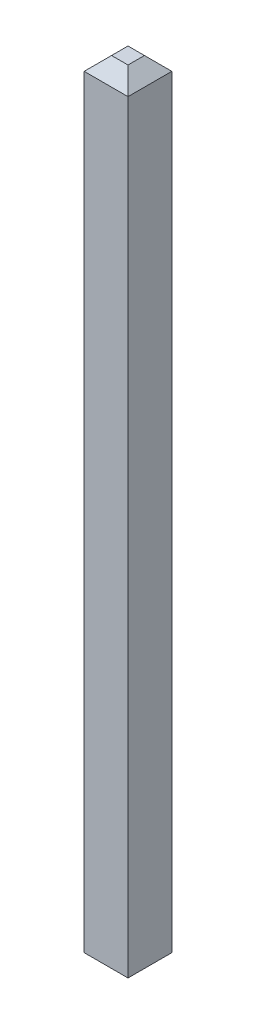
ISO-10303-21;
HEADER;
FILE_DESCRIPTION(('STEP AP214'),'2;1');
FILE_NAME('part.step','',(''),(''),'','','');
FILE_SCHEMA(('AUTOMOTIVE_DESIGN { 1 0 10303 214 1 1 1 1 }'));
ENDSEC;
DATA;
#1=APPLICATION_CONTEXT('core data for automotive mechanical design processes');
#2=APPLICATION_PROTOCOL_DEFINITION('international standard','automotive_design',2000,#1);
#3=PRODUCT_CONTEXT('',#1,'mechanical');
#4=PRODUCT('Part','Part','',(#3));
#5=PRODUCT_RELATED_PRODUCT_CATEGORY('part','',(#4));
#6=PRODUCT_DEFINITION_FORMATION('','',#4);
#7=PRODUCT_DEFINITION_CONTEXT('part definition',#1,'design');
#8=PRODUCT_DEFINITION('design','',#6,#7);
#9=PRODUCT_DEFINITION_SHAPE('','',#8);
#10=(LENGTH_UNIT() NAMED_UNIT(*) SI_UNIT(.MILLI.,.METRE.));
#11=(NAMED_UNIT(*) PLANE_ANGLE_UNIT() SI_UNIT($,.RADIAN.));
#12=(NAMED_UNIT(*) SI_UNIT($,.STERADIAN.) SOLID_ANGLE_UNIT());
#13=UNCERTAINTY_MEASURE_WITH_UNIT(LENGTH_MEASURE(1.E-05),#10,'distance_accuracy_value','');
#14=(GEOMETRIC_REPRESENTATION_CONTEXT(3) GLOBAL_UNCERTAINTY_ASSIGNED_CONTEXT((#13)) GLOBAL_UNIT_ASSIGNED_CONTEXT((#10,
#11,#12)) REPRESENTATION_CONTEXT('',''));
#15=CARTESIAN_POINT('',(0.,0.,0.));
#16=DIRECTION('',(0.,0.,1.));
#17=DIRECTION('',(1.,0.,0.));
#18=AXIS2_PLACEMENT_3D('',#15,#16,#17);
#19=CARTESIAN_POINT('',(4.13,7.07,-0.32));
#20=DIRECTION('',(-0.707106781186548,-0.707106781186548,0.));
#21=DIRECTION('',(-0.707106781186548,0.707106781186548,0.));
#22=AXIS2_PLACEMENT_3D('',#19,#20,#21);
#23=PLANE('',#22);
#24=DIRECTION('',(0.577350269189626,-0.577350269189626,0.577350269189626));
#25=VECTOR('',#24,1.);
#26=CARTESIAN_POINT('',(3.916666666667,7.283333333333,0.106666666667));
#27=LINE('',#26,#25);
#28=CARTESIAN_POINT('',(3.93,7.27,0.12));
#29=VERTEX_POINT('',#28);
#30=CARTESIAN_POINT('',(4.13,7.07,0.32));
#31=VERTEX_POINT('',#30);
#32=EDGE_CURVE('E73',#29,#31,#27,.T.);
#33=ORIENTED_EDGE('',*,*,#32,.T.);
#34=DIRECTION('',(0.,0.,1.));
#35=VECTOR('',#34,1.);
#36=CARTESIAN_POINT('',(4.13,7.07,-0.32));
#37=LINE('',#36,#35);
#38=CARTESIAN_POINT('',(4.13,7.07,-0.32));
#39=VERTEX_POINT('',#38);
#40=EDGE_CURVE('E169',#39,#31,#37,.T.);
#41=ORIENTED_EDGE('',*,*,#40,.F.);
#42=DIRECTION('',(0.577350269189626,-0.577350269189626,-0.577350269189626));
#43=VECTOR('',#42,1.);
#44=CARTESIAN_POINT('',(4.13,7.07,-0.32));
#45=LINE('',#44,#43);
#46=CARTESIAN_POINT('',(3.93,7.27,-0.12));
#47=VERTEX_POINT('',#46);
#48=EDGE_CURVE('E11',#47,#39,#45,.T.);
#49=ORIENTED_EDGE('',*,*,#48,.F.);
#50=DIRECTION('',(0.,0.,-1.));
#51=VECTOR('',#50,1.);
#52=CARTESIAN_POINT('',(3.93,7.27,-0.32));
#53=LINE('',#52,#51);
#54=EDGE_CURVE('E172',#29,#47,#53,.T.);
#55=ORIENTED_EDGE('',*,*,#54,.F.);
#56=EDGE_LOOP('',(#33,#41,#49,#55));
#57=FACE_BOUND('',#56,.T.);
#58=ADVANCED_FACE('F17',(#57),#23,.F.);
#59=CARTESIAN_POINT('',(3.81,7.07,-0.32));
#60=DIRECTION('',(0.,0.707106781186548,-0.707106781186548));
#61=DIRECTION('',(-1.,0.,0.));
#62=AXIS2_PLACEMENT_3D('',#59,#60,#61);
#63=PLANE('',#62);
#64=DIRECTION('',(0.577350269189626,0.577350269189626,0.577350269189626));
#65=VECTOR('',#64,1.);
#66=CARTESIAN_POINT('',(3.623333333333,7.203333333333,-0.186666666667));
#67=LINE('',#66,#65);
#68=CARTESIAN_POINT('',(3.49,7.07,-0.32));
#69=VERTEX_POINT('',#68);
#70=CARTESIAN_POINT('',(3.69,7.27,-0.12));
#71=VERTEX_POINT('',#70);
#72=EDGE_CURVE('E27',#69,#71,#67,.T.);
#73=ORIENTED_EDGE('',*,*,#72,.T.);
#74=DIRECTION('',(-1.,0.,0.));
#75=VECTOR('',#74,1.);
#76=CARTESIAN_POINT('',(3.49,7.27,-0.12));
#77=LINE('',#76,#75);
#78=EDGE_CURVE('E176',#47,#71,#77,.T.);
#79=ORIENTED_EDGE('',*,*,#78,.F.);
#80=ORIENTED_EDGE('',*,*,#48,.T.);
#81=DIRECTION('',(1.,0.,0.));
#82=VECTOR('',#81,1.);
#83=CARTESIAN_POINT('',(4.13,7.07,-0.32));
#84=LINE('',#83,#82);
#85=EDGE_CURVE('E131',#69,#39,#84,.T.);
#86=ORIENTED_EDGE('',*,*,#85,.F.);
#87=EDGE_LOOP('',(#73,#79,#80,#86));
#88=FACE_BOUND('',#87,.T.);
#89=ADVANCED_FACE('F19',(#88),#63,.T.);
#90=CARTESIAN_POINT('',(3.69,7.27,-0.32));
#91=DIRECTION('',(0.707106781186548,-0.707106781186548,0.));
#92=DIRECTION('',(0.,0.,-1.));
#93=AXIS2_PLACEMENT_3D('',#90,#91,#92);
#94=PLANE('',#93);
#95=DIRECTION('',(-0.577350269189626,-0.577350269189626,0.577350269189626));
#96=VECTOR('',#95,1.);
#97=CARTESIAN_POINT('',(3.623333333333,7.203333333333,0.186666666667));
#98=LINE('',#97,#96);
#99=CARTESIAN_POINT('',(3.69,7.27,0.12));
#100=VERTEX_POINT('',#99);
#101=CARTESIAN_POINT('',(3.49,7.07,0.32));
#102=VERTEX_POINT('',#101);
#103=EDGE_CURVE('E40',#100,#102,#98,.T.);
#104=ORIENTED_EDGE('',*,*,#103,.F.);
#105=DIRECTION('',(0.,0.,1.));
#106=VECTOR('',#105,1.);
#107=CARTESIAN_POINT('',(3.69,7.27,-0.32));
#108=LINE('',#107,#106);
#109=EDGE_CURVE('E113',#71,#100,#108,.T.);
#110=ORIENTED_EDGE('',*,*,#109,.F.);
#111=ORIENTED_EDGE('',*,*,#72,.F.);
#112=DIRECTION('',(0.,0.,-1.));
#113=VECTOR('',#112,1.);
#114=CARTESIAN_POINT('',(3.49,7.07,-0.32));
#115=LINE('',#114,#113);
#116=EDGE_CURVE('E110',#102,#69,#115,.T.);
#117=ORIENTED_EDGE('',*,*,#116,.F.);
#118=EDGE_LOOP('',(#104,#110,#111,#117));
#119=FACE_BOUND('',#118,.T.);
#120=ADVANCED_FACE('F109',(#119),#94,.F.);
#121=CARTESIAN_POINT('',(3.49,7.27,0.12));
#122=DIRECTION('',(0.,-0.707106781186548,-0.707106781186548));
#123=DIRECTION('',(0.,-0.707106781186548,0.707106781186548));
#124=AXIS2_PLACEMENT_3D('',#121,#122,#123);
#125=PLANE('',#124);
#126=ORIENTED_EDGE('',*,*,#32,.F.);
#127=DIRECTION('',(1.,0.,0.));
#128=VECTOR('',#127,1.);
#129=CARTESIAN_POINT('',(3.49,7.27,0.12));
#130=LINE('',#129,#128);
#131=EDGE_CURVE('E181',#100,#29,#130,.T.);
#132=ORIENTED_EDGE('',*,*,#131,.F.);
#133=ORIENTED_EDGE('',*,*,#103,.T.);
#134=DIRECTION('',(-1.,0.,0.));
#135=VECTOR('',#134,1.);
#136=CARTESIAN_POINT('',(3.81,7.07,0.32));
#137=LINE('',#136,#135);
#138=EDGE_CURVE('E164',#31,#102,#137,.T.);
#139=ORIENTED_EDGE('',*,*,#138,.F.);
#140=EDGE_LOOP('',(#126,#132,#133,#139));
#141=FACE_BOUND('',#140,.T.);
#142=ADVANCED_FACE('F197',(#141),#125,.F.);
#143=CARTESIAN_POINT('',(3.49,7.27,-0.32));
#144=DIRECTION('',(0.,-1.,0.));
#145=DIRECTION('',(0.,0.,-1.));
#146=AXIS2_PLACEMENT_3D('',#143,#144,#145);
#147=PLANE('',#146);
#148=ORIENTED_EDGE('',*,*,#54,.T.);
#149=ORIENTED_EDGE('',*,*,#78,.T.);
#150=ORIENTED_EDGE('',*,*,#109,.T.);
#151=ORIENTED_EDGE('',*,*,#131,.T.);
#152=EDGE_LOOP('',(#148,#149,#150,#151));
#153=FACE_BOUND('',#152,.T.);
#154=ADVANCED_FACE('F207',(#153),#147,.F.);
#155=CARTESIAN_POINT('',(4.13,7.27,-0.32));
#156=DIRECTION('',(-1.,0.,0.));
#157=DIRECTION('',(0.,1.,0.));
#158=AXIS2_PLACEMENT_3D('',#155,#156,#157);
#159=PLANE('',#158);
#160=DIRECTION('',(0.,-1.,0.));
#161=VECTOR('',#160,1.);
#162=CARTESIAN_POINT('',(4.13,7.27,-0.32));
#163=LINE('',#162,#161);
#164=CARTESIAN_POINT('',(4.13,-4.07,-0.32));
#165=VERTEX_POINT('',#164);
#166=EDGE_CURVE('E135',#39,#165,#163,.T.);
#167=ORIENTED_EDGE('',*,*,#166,.F.);
#168=ORIENTED_EDGE('',*,*,#40,.T.);
#169=DIRECTION('',(0.,-1.,0.));
#170=VECTOR('',#169,1.);
#171=CARTESIAN_POINT('',(4.13,7.27,0.32));
#172=LINE('',#171,#170);
#173=CARTESIAN_POINT('',(4.13,-4.07,0.32));
#174=VERTEX_POINT('',#173);
#175=EDGE_CURVE('E161',#31,#174,#172,.T.);
#176=ORIENTED_EDGE('',*,*,#175,.T.);
#177=DIRECTION('',(0.,0.,-1.));
#178=VECTOR('',#177,1.);
#179=CARTESIAN_POINT('',(4.13,-4.07,-0.32));
#180=LINE('',#179,#178);
#181=EDGE_CURVE('E165',#174,#165,#180,.T.);
#182=ORIENTED_EDGE('',*,*,#181,.T.);
#183=EDGE_LOOP('',(#167,#168,#176,#182));
#184=FACE_BOUND('',#183,.T.);
#185=ADVANCED_FACE('F212',(#184),#159,.F.);
#186=CARTESIAN_POINT('',(3.81,1.5,0.32));
#187=DIRECTION('',(0.,0.,-1.));
#188=DIRECTION('',(0.,-1.,0.));
#189=AXIS2_PLACEMENT_3D('',#186,#187,#188);
#190=PLANE('',#189);
#191=ORIENTED_EDGE('',*,*,#175,.F.);
#192=ORIENTED_EDGE('',*,*,#138,.T.);
#193=DIRECTION('',(0.,1.,0.));
#194=VECTOR('',#193,1.);
#195=CARTESIAN_POINT('',(3.49,-4.27,0.32));
#196=LINE('',#195,#194);
#197=CARTESIAN_POINT('',(3.49,-4.07,0.32));
#198=VERTEX_POINT('',#197);
#199=EDGE_CURVE('E126',#198,#102,#196,.T.);
#200=ORIENTED_EDGE('',*,*,#199,.F.);
#201=DIRECTION('',(1.,0.,0.));
#202=VECTOR('',#201,1.);
#203=CARTESIAN_POINT('',(3.81,-4.07,0.32));
#204=LINE('',#203,#202);
#205=EDGE_CURVE('E357',#198,#174,#204,.T.);
#206=ORIENTED_EDGE('',*,*,#205,.T.);
#207=EDGE_LOOP('',(#191,#192,#200,#206));
#208=FACE_BOUND('',#207,.T.);
#209=ADVANCED_FACE('F236',(#208),#190,.F.);
#210=CARTESIAN_POINT('',(3.93,-4.27,-0.32));
#211=DIRECTION('',(-0.707106781186548,0.707106781186548,0.));
#212=DIRECTION('',(0.,0.,1.));
#213=AXIS2_PLACEMENT_3D('',#210,#211,#212);
#214=PLANE('',#213);
#215=DIRECTION('',(-0.577350269189626,-0.577350269189626,0.577350269189626));
#216=VECTOR('',#215,1.);
#217=CARTESIAN_POINT('',(3.996666666667,-4.203333333333,-0.186666666667));
#218=LINE('',#217,#216);
#219=CARTESIAN_POINT('',(3.93,-4.27,-0.12));
#220=VERTEX_POINT('',#219);
#221=EDGE_CURVE('E142',#165,#220,#218,.T.);
#222=ORIENTED_EDGE('',*,*,#221,.F.);
#223=ORIENTED_EDGE('',*,*,#181,.F.);
#224=DIRECTION('',(-0.577350269189626,-0.577350269189626,-0.577350269189626));
#225=VECTOR('',#224,1.);
#226=CARTESIAN_POINT('',(3.783333333333,-4.416666666667,-0.02666666666667));
#227=LINE('',#226,#225);
#228=CARTESIAN_POINT('',(3.93,-4.27,0.12));
#229=VERTEX_POINT('',#228);
#230=EDGE_CURVE('E355',#174,#229,#227,.T.);
#231=ORIENTED_EDGE('',*,*,#230,.T.);
#232=DIRECTION('',(0.,0.,1.));
#233=VECTOR('',#232,1.);
#234=CARTESIAN_POINT('',(3.93,-4.27,-0.32));
#235=LINE('',#234,#233);
#236=EDGE_CURVE('E377',#220,#229,#235,.T.);
#237=ORIENTED_EDGE('',*,*,#236,.F.);
#238=EDGE_LOOP('',(#222,#223,#231,#237));
#239=FACE_BOUND('',#238,.T.);
#240=ADVANCED_FACE('F247',(#239),#214,.F.);
#241=CARTESIAN_POINT('',(4.13,-4.27,0.12));
#242=DIRECTION('',(0.,0.707106781186548,-0.707106781186548));
#243=DIRECTION('',(-1.,0.,0.));
#244=AXIS2_PLACEMENT_3D('',#241,#242,#243);
#245=PLANE('',#244);
#246=ORIENTED_EDGE('',*,*,#230,.F.);
#247=ORIENTED_EDGE('',*,*,#205,.F.);
#248=DIRECTION('',(-0.577350269189626,0.577350269189626,0.577350269189626));
#249=VECTOR('',#248,1.);
#250=CARTESIAN_POINT('',(3.703333333333,-4.283333333333,0.106666666667));
#251=LINE('',#250,#249);
#252=CARTESIAN_POINT('',(3.69,-4.27,0.12));
#253=VERTEX_POINT('',#252);
#254=EDGE_CURVE('E158',#253,#198,#251,.T.);
#255=ORIENTED_EDGE('',*,*,#254,.F.);
#256=DIRECTION('',(-1.,0.,0.));
#257=VECTOR('',#256,1.);
#258=CARTESIAN_POINT('',(4.13,-4.27,0.12));
#259=LINE('',#258,#257);
#260=EDGE_CURVE('E360',#229,#253,#259,.T.);
#261=ORIENTED_EDGE('',*,*,#260,.F.);
#262=EDGE_LOOP('',(#246,#247,#255,#261));
#263=FACE_BOUND('',#262,.T.);
#264=ADVANCED_FACE('F258',(#263),#245,.F.);
#265=CARTESIAN_POINT('',(3.49,-4.07,-0.32));
#266=DIRECTION('',(0.707106781186548,0.707106781186548,0.));
#267=DIRECTION('',(0.,0.,-1.));
#268=AXIS2_PLACEMENT_3D('',#265,#266,#267);
#269=PLANE('',#268);
#270=DIRECTION('',(0.577350269189626,-0.577350269189626,0.577350269189626));
#271=VECTOR('',#270,1.);
#272=CARTESIAN_POINT('',(3.596666666667,-4.176666666667,-0.213333333333));
#273=LINE('',#272,#271);
#274=CARTESIAN_POINT('',(3.49,-4.07,-0.32));
#275=VERTEX_POINT('',#274);
#276=CARTESIAN_POINT('',(3.69,-4.27,-0.12));
#277=VERTEX_POINT('',#276);
#278=EDGE_CURVE('E378',#275,#277,#273,.T.);
#279=ORIENTED_EDGE('',*,*,#278,.T.);
#280=DIRECTION('',(0.,0.,-1.));
#281=VECTOR('',#280,1.);
#282=CARTESIAN_POINT('',(3.69,-4.27,-0.32));
#283=LINE('',#282,#281);
#284=EDGE_CURVE('E372',#253,#277,#283,.T.);
#285=ORIENTED_EDGE('',*,*,#284,.F.);
#286=ORIENTED_EDGE('',*,*,#254,.T.);
#287=DIRECTION('',(0.,0.,1.));
#288=VECTOR('',#287,1.);
#289=CARTESIAN_POINT('',(3.49,-4.07,-0.32));
#290=LINE('',#289,#288);
#291=EDGE_CURVE('E128',#275,#198,#290,.T.);
#292=ORIENTED_EDGE('',*,*,#291,.F.);
#293=EDGE_LOOP('',(#279,#285,#286,#292));
#294=FACE_BOUND('',#293,.T.);
#295=ADVANCED_FACE('F288',(#294),#269,.F.);
#296=CARTESIAN_POINT('',(3.49,-4.27,-0.32));
#297=DIRECTION('',(1.,0.,0.));
#298=DIRECTION('',(0.,0.,1.));
#299=AXIS2_PLACEMENT_3D('',#296,#297,#298);
#300=PLANE('',#299);
#301=ORIENTED_EDGE('',*,*,#199,.T.);
#302=ORIENTED_EDGE('',*,*,#116,.T.);
#303=DIRECTION('',(0.,1.,0.));
#304=VECTOR('',#303,1.);
#305=CARTESIAN_POINT('',(3.49,-4.27,-0.32));
#306=LINE('',#305,#304);
#307=EDGE_CURVE('E123',#275,#69,#306,.T.);
#308=ORIENTED_EDGE('',*,*,#307,.F.);
#309=ORIENTED_EDGE('',*,*,#291,.T.);
#310=EDGE_LOOP('',(#301,#302,#308,#309));
#311=FACE_BOUND('',#310,.T.);
#312=ADVANCED_FACE('F120',(#311),#300,.F.);
#313=CARTESIAN_POINT('',(3.81,1.5,-0.32));
#314=DIRECTION('',(0.,0.,-1.));
#315=DIRECTION('',(0.,-1.,0.));
#316=AXIS2_PLACEMENT_3D('',#313,#314,#315);
#317=PLANE('',#316);
#318=ORIENTED_EDGE('',*,*,#307,.T.);
#319=ORIENTED_EDGE('',*,*,#85,.T.);
#320=ORIENTED_EDGE('',*,*,#166,.T.);
#321=DIRECTION('',(-1.,0.,0.));
#322=VECTOR('',#321,1.);
#323=CARTESIAN_POINT('',(3.49,-4.07,-0.32));
#324=LINE('',#323,#322);
#325=EDGE_CURVE('E139',#165,#275,#324,.T.);
#326=ORIENTED_EDGE('',*,*,#325,.T.);
#327=EDGE_LOOP('',(#318,#319,#320,#326));
#328=FACE_BOUND('',#327,.T.);
#329=ADVANCED_FACE('F137',(#328),#317,.T.);
#330=CARTESIAN_POINT('',(3.81,-4.07,-0.32));
#331=DIRECTION('',(0.,-0.707106781186548,-0.707106781186548));
#332=DIRECTION('',(0.,-0.707106781186548,0.707106781186548));
#333=AXIS2_PLACEMENT_3D('',#330,#331,#332);
#334=PLANE('',#333);
#335=ORIENTED_EDGE('',*,*,#278,.F.);
#336=ORIENTED_EDGE('',*,*,#325,.F.);
#337=ORIENTED_EDGE('',*,*,#221,.T.);
#338=DIRECTION('',(1.,0.,0.));
#339=VECTOR('',#338,1.);
#340=CARTESIAN_POINT('',(4.13,-4.27,-0.12));
#341=LINE('',#340,#339);
#342=EDGE_CURVE('E151',#277,#220,#341,.T.);
#343=ORIENTED_EDGE('',*,*,#342,.F.);
#344=EDGE_LOOP('',(#335,#336,#337,#343));
#345=FACE_BOUND('',#344,.T.);
#346=ADVANCED_FACE('F225',(#345),#334,.T.);
#347=CARTESIAN_POINT('',(4.13,-4.27,-0.32));
#348=DIRECTION('',(0.,1.,0.));
#349=DIRECTION('',(0.,0.,-1.));
#350=AXIS2_PLACEMENT_3D('',#347,#348,#349);
#351=PLANE('',#350);
#352=ORIENTED_EDGE('',*,*,#236,.T.);
#353=ORIENTED_EDGE('',*,*,#260,.T.);
#354=ORIENTED_EDGE('',*,*,#284,.T.);
#355=ORIENTED_EDGE('',*,*,#342,.T.);
#356=EDGE_LOOP('',(#352,#353,#354,#355));
#357=FACE_BOUND('',#356,.T.);
#358=ADVANCED_FACE('F220',(#357),#351,.F.);
#359=CLOSED_SHELL('',(#58,#89,#120,#142,#154,#185,#209,#240,#264,#295,#312,#329,#346,#358));
#360=MANIFOLD_SOLID_BREP('B1',#359);
#361=ADVANCED_BREP_SHAPE_REPRESENTATION('',(#18,#360),#14);
#362=SHAPE_DEFINITION_REPRESENTATION(#9,#361);
ENDSEC;
END-ISO-10303-21;
